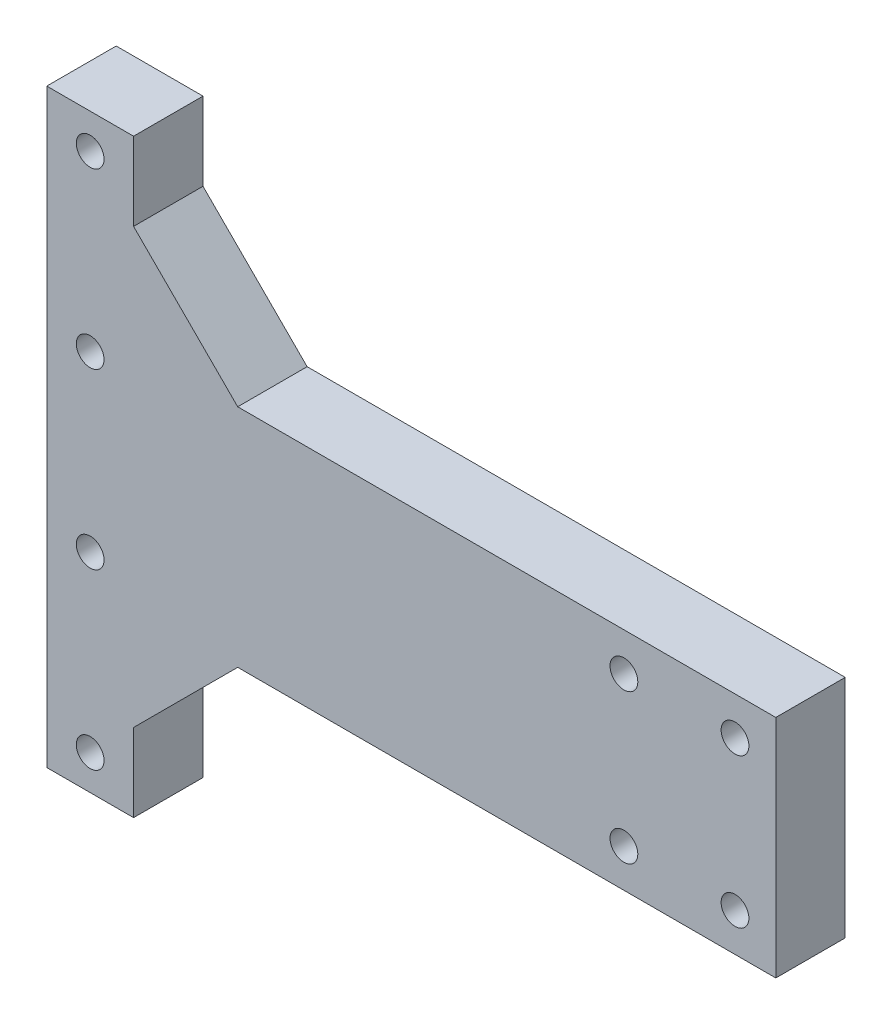
ISO-10303-21;
HEADER;
FILE_DESCRIPTION(('STEP AP214'),'2;1');
FILE_NAME('part.step','',(''),(''),'','','');
FILE_SCHEMA(('AUTOMOTIVE_DESIGN { 1 0 10303 214 1 1 1 1 }'));
ENDSEC;
DATA;
#1=APPLICATION_CONTEXT('core data for automotive mechanical design processes');
#2=APPLICATION_PROTOCOL_DEFINITION('international standard','automotive_design',2000,#1);
#3=PRODUCT_CONTEXT('',#1,'mechanical');
#4=PRODUCT('Part','Part','',(#3));
#5=PRODUCT_RELATED_PRODUCT_CATEGORY('part','',(#4));
#6=PRODUCT_DEFINITION_FORMATION('','',#4);
#7=PRODUCT_DEFINITION_CONTEXT('part definition',#1,'design');
#8=PRODUCT_DEFINITION('design','',#6,#7);
#9=PRODUCT_DEFINITION_SHAPE('','',#8);
#10=(LENGTH_UNIT() NAMED_UNIT(*) SI_UNIT(.MILLI.,.METRE.));
#11=(NAMED_UNIT(*) PLANE_ANGLE_UNIT() SI_UNIT($,.RADIAN.));
#12=(NAMED_UNIT(*) SI_UNIT($,.STERADIAN.) SOLID_ANGLE_UNIT());
#13=UNCERTAINTY_MEASURE_WITH_UNIT(LENGTH_MEASURE(1.E-05),#10,'distance_accuracy_value','');
#14=(GEOMETRIC_REPRESENTATION_CONTEXT(3) GLOBAL_UNCERTAINTY_ASSIGNED_CONTEXT((#13)) GLOBAL_UNIT_ASSIGNED_CONTEXT((#10,
#11,#12)) REPRESENTATION_CONTEXT('',''));
#15=CARTESIAN_POINT('',(0.,0.,0.));
#16=DIRECTION('',(0.,0.,1.));
#17=DIRECTION('',(1.,0.,0.));
#18=AXIS2_PLACEMENT_3D('',#15,#16,#17);
#19=CARTESIAN_POINT('',(0.,0.,40.));
#20=DIRECTION('',(0.,1.,0.));
#21=DIRECTION('',(0.,0.,1.));
#22=AXIS2_PLACEMENT_3D('',#19,#20,#21);
#23=PLANE('',#22);
#24=DIRECTION('',(1.,0.,0.));
#25=VECTOR('',#24,1.);
#26=CARTESIAN_POINT('',(0.,0.,0.));
#27=LINE('',#26,#25);
#28=CARTESIAN_POINT('',(0.,0.,0.));
#29=VERTEX_POINT('',#28);
#30=CARTESIAN_POINT('',(50.,0.,0.));
#31=VERTEX_POINT('',#30);
#32=EDGE_CURVE('E154',#29,#31,#27,.T.);
#33=ORIENTED_EDGE('',*,*,#32,.T.);
#34=DIRECTION('',(0.,0.,-1.));
#35=VECTOR('',#34,1.);
#36=CARTESIAN_POINT('',(50.,0.,40.));
#37=LINE('',#36,#35);
#38=CARTESIAN_POINT('',(50.,0.,40.));
#39=VERTEX_POINT('',#38);
#40=EDGE_CURVE('E11',#39,#31,#37,.T.);
#41=ORIENTED_EDGE('',*,*,#40,.F.);
#42=DIRECTION('',(1.,0.,0.));
#43=VECTOR('',#42,1.);
#44=CARTESIAN_POINT('',(0.,0.,40.));
#45=LINE('',#44,#43);
#46=CARTESIAN_POINT('',(0.,0.,40.));
#47=VERTEX_POINT('',#46);
#48=EDGE_CURVE('E183',#47,#39,#45,.T.);
#49=ORIENTED_EDGE('',*,*,#48,.F.);
#50=DIRECTION('',(0.,0.,-1.));
#51=VECTOR('',#50,1.);
#52=CARTESIAN_POINT('',(0.,0.,40.));
#53=LINE('',#52,#51);
#54=EDGE_CURVE('E150',#47,#29,#53,.T.);
#55=ORIENTED_EDGE('',*,*,#54,.T.);
#56=EDGE_LOOP('',(#33,#41,#49,#55));
#57=FACE_BOUND('',#56,.T.);
#58=ADVANCED_FACE('F39',(#57),#23,.F.);
#59=CARTESIAN_POINT('',(50.,0.,40.));
#60=DIRECTION('',(-1.,0.,0.));
#61=DIRECTION('',(0.,0.,1.));
#62=AXIS2_PLACEMENT_3D('',#59,#60,#61);
#63=PLANE('',#62);
#64=DIRECTION('',(0.,1.,0.));
#65=VECTOR('',#64,1.);
#66=CARTESIAN_POINT('',(50.,0.,0.));
#67=LINE('',#66,#65);
#68=CARTESIAN_POINT('',(50.,45.,0.));
#69=VERTEX_POINT('',#68);
#70=EDGE_CURVE('E158',#31,#69,#67,.T.);
#71=ORIENTED_EDGE('',*,*,#70,.T.);
#72=DIRECTION('',(0.,0.,-1.));
#73=VECTOR('',#72,1.);
#74=CARTESIAN_POINT('',(50.,45.,40.));
#75=LINE('',#74,#73);
#76=CARTESIAN_POINT('',(50.,45.,40.));
#77=VERTEX_POINT('',#76);
#78=EDGE_CURVE('E49',#77,#69,#75,.T.);
#79=ORIENTED_EDGE('',*,*,#78,.F.);
#80=DIRECTION('',(0.,1.,0.));
#81=VECTOR('',#80,1.);
#82=CARTESIAN_POINT('',(50.,0.,40.));
#83=LINE('',#82,#81);
#84=EDGE_CURVE('E107',#39,#77,#83,.T.);
#85=ORIENTED_EDGE('',*,*,#84,.F.);
#86=ORIENTED_EDGE('',*,*,#40,.T.);
#87=EDGE_LOOP('',(#71,#79,#85,#86));
#88=FACE_BOUND('',#87,.T.);
#89=ADVANCED_FACE('F325',(#88),#63,.F.);
#90=CARTESIAN_POINT('',(50.,45.,40.));
#91=DIRECTION('',(-0.707106781186546,0.707106781186549,0.));
#92=DIRECTION('',(-0.707106781186549,-0.707106781186546,0.));
#93=AXIS2_PLACEMENT_3D('',#90,#91,#92);
#94=PLANE('',#93);
#95=DIRECTION('',(0.707106781186549,0.707106781186546,0.));
#96=VECTOR('',#95,1.);
#97=CARTESIAN_POINT('',(50.,45.,0.));
#98=LINE('',#97,#96);
#99=CARTESIAN_POINT('',(110.,105.,0.));
#100=VERTEX_POINT('',#99);
#101=EDGE_CURVE('E162',#69,#100,#98,.T.);
#102=ORIENTED_EDGE('',*,*,#101,.T.);
#103=DIRECTION('',(0.,0.,-1.));
#104=VECTOR('',#103,1.);
#105=CARTESIAN_POINT('',(110.,105.,40.));
#106=LINE('',#105,#104);
#107=CARTESIAN_POINT('',(110.,105.,40.));
#108=VERTEX_POINT('',#107);
#109=EDGE_CURVE('E202',#108,#100,#106,.T.);
#110=ORIENTED_EDGE('',*,*,#109,.F.);
#111=DIRECTION('',(0.707106781186549,0.707106781186546,0.));
#112=VECTOR('',#111,1.);
#113=CARTESIAN_POINT('',(50.,45.,40.));
#114=LINE('',#113,#112);
#115=EDGE_CURVE('E273',#77,#108,#114,.T.);
#116=ORIENTED_EDGE('',*,*,#115,.F.);
#117=ORIENTED_EDGE('',*,*,#78,.T.);
#118=EDGE_LOOP('',(#102,#110,#116,#117));
#119=FACE_BOUND('',#118,.T.);
#120=ADVANCED_FACE('F329',(#119),#94,.F.);
#121=CARTESIAN_POINT('',(110.,105.,40.));
#122=DIRECTION('',(0.,1.,0.));
#123=DIRECTION('',(0.,0.,1.));
#124=AXIS2_PLACEMENT_3D('',#121,#122,#123);
#125=PLANE('',#124);
#126=DIRECTION('',(1.,0.,0.));
#127=VECTOR('',#126,1.);
#128=CARTESIAN_POINT('',(110.,105.,0.));
#129=LINE('',#128,#127);
#130=CARTESIAN_POINT('',(420.,105.,0.));
#131=VERTEX_POINT('',#130);
#132=EDGE_CURVE('E165',#100,#131,#129,.T.);
#133=ORIENTED_EDGE('',*,*,#132,.T.);
#134=DIRECTION('',(0.,0.,-1.));
#135=VECTOR('',#134,1.);
#136=CARTESIAN_POINT('',(420.,105.,40.));
#137=LINE('',#136,#135);
#138=CARTESIAN_POINT('',(420.,105.,40.));
#139=VERTEX_POINT('',#138);
#140=EDGE_CURVE('E198',#139,#131,#137,.T.);
#141=ORIENTED_EDGE('',*,*,#140,.F.);
#142=DIRECTION('',(1.,0.,0.));
#143=VECTOR('',#142,1.);
#144=CARTESIAN_POINT('',(110.,105.,40.));
#145=LINE('',#144,#143);
#146=EDGE_CURVE('E276',#108,#139,#145,.T.);
#147=ORIENTED_EDGE('',*,*,#146,.F.);
#148=ORIENTED_EDGE('',*,*,#109,.T.);
#149=EDGE_LOOP('',(#133,#141,#147,#148));
#150=FACE_BOUND('',#149,.T.);
#151=ADVANCED_FACE('F333',(#150),#125,.F.);
#152=CARTESIAN_POINT('',(420.,235.,40.));
#153=DIRECTION('',(-1.,0.,0.));
#154=DIRECTION('',(0.,0.,1.));
#155=AXIS2_PLACEMENT_3D('',#152,#153,#154);
#156=PLANE('',#155);
#157=DIRECTION('',(0.,1.,0.));
#158=VECTOR('',#157,1.);
#159=CARTESIAN_POINT('',(420.,235.,0.));
#160=LINE('',#159,#158);
#161=CARTESIAN_POINT('',(420.,235.,0.));
#162=VERTEX_POINT('',#161);
#163=EDGE_CURVE('E168',#131,#162,#160,.T.);
#164=ORIENTED_EDGE('',*,*,#163,.T.);
#165=DIRECTION('',(0.,0.,-1.));
#166=VECTOR('',#165,1.);
#167=CARTESIAN_POINT('',(420.,235.,40.));
#168=LINE('',#167,#166);
#169=CARTESIAN_POINT('',(420.,235.,40.));
#170=VERTEX_POINT('',#169);
#171=EDGE_CURVE('E194',#170,#162,#168,.T.);
#172=ORIENTED_EDGE('',*,*,#171,.F.);
#173=DIRECTION('',(0.,1.,0.));
#174=VECTOR('',#173,1.);
#175=CARTESIAN_POINT('',(420.,235.,40.));
#176=LINE('',#175,#174);
#177=EDGE_CURVE('E279',#139,#170,#176,.T.);
#178=ORIENTED_EDGE('',*,*,#177,.F.);
#179=ORIENTED_EDGE('',*,*,#140,.T.);
#180=EDGE_LOOP('',(#164,#172,#178,#179));
#181=FACE_BOUND('',#180,.T.);
#182=ADVANCED_FACE('F339',(#181),#156,.F.);
#183=CARTESIAN_POINT('',(110.,235.,40.));
#184=DIRECTION('',(0.,-1.,0.));
#185=DIRECTION('',(0.,0.,-1.));
#186=AXIS2_PLACEMENT_3D('',#183,#184,#185);
#187=PLANE('',#186);
#188=DIRECTION('',(-1.,0.,0.));
#189=VECTOR('',#188,1.);
#190=CARTESIAN_POINT('',(110.,235.,0.));
#191=LINE('',#190,#189);
#192=CARTESIAN_POINT('',(110.,235.,0.));
#193=VERTEX_POINT('',#192);
#194=EDGE_CURVE('E171',#162,#193,#191,.T.);
#195=ORIENTED_EDGE('',*,*,#194,.T.);
#196=DIRECTION('',(0.,0.,-1.));
#197=VECTOR('',#196,1.);
#198=CARTESIAN_POINT('',(110.,235.,40.));
#199=LINE('',#198,#197);
#200=CARTESIAN_POINT('',(110.,235.,40.));
#201=VERTEX_POINT('',#200);
#202=EDGE_CURVE('E190',#201,#193,#199,.T.);
#203=ORIENTED_EDGE('',*,*,#202,.F.);
#204=DIRECTION('',(-1.,0.,0.));
#205=VECTOR('',#204,1.);
#206=CARTESIAN_POINT('',(110.,235.,40.));
#207=LINE('',#206,#205);
#208=EDGE_CURVE('E282',#170,#201,#207,.T.);
#209=ORIENTED_EDGE('',*,*,#208,.F.);
#210=ORIENTED_EDGE('',*,*,#171,.T.);
#211=EDGE_LOOP('',(#195,#203,#209,#210));
#212=FACE_BOUND('',#211,.T.);
#213=ADVANCED_FACE('F343',(#212),#187,.F.);
#214=CARTESIAN_POINT('',(49.9999999999999,295.,40.));
#215=DIRECTION('',(-0.707106781186548,-0.707106781186547,0.));
#216=DIRECTION('',(0.707106781186547,-0.707106781186548,0.));
#217=AXIS2_PLACEMENT_3D('',#214,#215,#216);
#218=PLANE('',#217);
#219=DIRECTION('',(-0.707106781186547,0.707106781186548,0.));
#220=VECTOR('',#219,1.);
#221=CARTESIAN_POINT('',(49.9999999999999,295.,0.));
#222=LINE('',#221,#220);
#223=CARTESIAN_POINT('',(49.9999999999999,295.,0.));
#224=VERTEX_POINT('',#223);
#225=EDGE_CURVE('E174',#193,#224,#222,.T.);
#226=ORIENTED_EDGE('',*,*,#225,.T.);
#227=DIRECTION('',(0.,0.,-1.));
#228=VECTOR('',#227,1.);
#229=CARTESIAN_POINT('',(49.9999999999999,295.,40.));
#230=LINE('',#229,#228);
#231=CARTESIAN_POINT('',(49.9999999999999,295.,40.));
#232=VERTEX_POINT('',#231);
#233=EDGE_CURVE('E143',#232,#224,#230,.T.);
#234=ORIENTED_EDGE('',*,*,#233,.F.);
#235=DIRECTION('',(-0.707106781186547,0.707106781186548,0.));
#236=VECTOR('',#235,1.);
#237=CARTESIAN_POINT('',(49.9999999999999,295.,40.));
#238=LINE('',#237,#236);
#239=EDGE_CURVE('E132',#201,#232,#238,.T.);
#240=ORIENTED_EDGE('',*,*,#239,.F.);
#241=ORIENTED_EDGE('',*,*,#202,.T.);
#242=EDGE_LOOP('',(#226,#234,#240,#241));
#243=FACE_BOUND('',#242,.T.);
#244=ADVANCED_FACE('F347',(#243),#218,.F.);
#245=CARTESIAN_POINT('',(49.9999999999999,340.,40.));
#246=DIRECTION('',(-1.,0.,0.));
#247=DIRECTION('',(0.,-1.,0.));
#248=AXIS2_PLACEMENT_3D('',#245,#246,#247);
#249=PLANE('',#248);
#250=DIRECTION('',(0.,1.,0.));
#251=VECTOR('',#250,1.);
#252=CARTESIAN_POINT('',(49.9999999999999,340.,0.));
#253=LINE('',#252,#251);
#254=CARTESIAN_POINT('',(49.9999999999999,340.,0.));
#255=VERTEX_POINT('',#254);
#256=EDGE_CURVE('E141',#224,#255,#253,.T.);
#257=ORIENTED_EDGE('',*,*,#256,.T.);
#258=DIRECTION('',(0.,0.,-1.));
#259=VECTOR('',#258,1.);
#260=CARTESIAN_POINT('',(49.9999999999999,340.,40.));
#261=LINE('',#260,#259);
#262=CARTESIAN_POINT('',(49.9999999999999,340.,40.));
#263=VERTEX_POINT('',#262);
#264=EDGE_CURVE('E138',#263,#255,#261,.T.);
#265=ORIENTED_EDGE('',*,*,#264,.F.);
#266=DIRECTION('',(0.,1.,0.));
#267=VECTOR('',#266,1.);
#268=CARTESIAN_POINT('',(49.9999999999999,340.,40.));
#269=LINE('',#268,#267);
#270=EDGE_CURVE('E126',#232,#263,#269,.T.);
#271=ORIENTED_EDGE('',*,*,#270,.F.);
#272=ORIENTED_EDGE('',*,*,#233,.T.);
#273=EDGE_LOOP('',(#257,#265,#271,#272));
#274=FACE_BOUND('',#273,.T.);
#275=ADVANCED_FACE('F139',(#274),#249,.F.);
#276=CARTESIAN_POINT('',(0.,340.,40.));
#277=DIRECTION('',(0.,-1.,0.));
#278=DIRECTION('',(1.,0.,0.));
#279=AXIS2_PLACEMENT_3D('',#276,#277,#278);
#280=PLANE('',#279);
#281=DIRECTION('',(-1.,0.,0.));
#282=VECTOR('',#281,1.);
#283=CARTESIAN_POINT('',(0.,340.,0.));
#284=LINE('',#283,#282);
#285=CARTESIAN_POINT('',(0.,340.,0.));
#286=VERTEX_POINT('',#285);
#287=EDGE_CURVE('E93',#255,#286,#284,.T.);
#288=ORIENTED_EDGE('',*,*,#287,.T.);
#289=DIRECTION('',(0.,0.,-1.));
#290=VECTOR('',#289,1.);
#291=CARTESIAN_POINT('',(0.,340.,40.));
#292=LINE('',#291,#290);
#293=CARTESIAN_POINT('',(0.,340.,40.));
#294=VERTEX_POINT('',#293);
#295=EDGE_CURVE('E144',#294,#286,#292,.T.);
#296=ORIENTED_EDGE('',*,*,#295,.F.);
#297=DIRECTION('',(-1.,0.,0.));
#298=VECTOR('',#297,1.);
#299=CARTESIAN_POINT('',(0.,340.,40.));
#300=LINE('',#299,#298);
#301=EDGE_CURVE('E130',#263,#294,#300,.T.);
#302=ORIENTED_EDGE('',*,*,#301,.F.);
#303=ORIENTED_EDGE('',*,*,#264,.T.);
#304=EDGE_LOOP('',(#288,#296,#302,#303));
#305=FACE_BOUND('',#304,.T.);
#306=ADVANCED_FACE('F146',(#305),#280,.F.);
#307=CARTESIAN_POINT('',(0.,0.,40.));
#308=DIRECTION('',(1.,0.,0.));
#309=DIRECTION('',(0.,0.,-1.));
#310=AXIS2_PLACEMENT_3D('',#307,#308,#309);
#311=PLANE('',#310);
#312=DIRECTION('',(0.,-1.,0.));
#313=VECTOR('',#312,1.);
#314=CARTESIAN_POINT('',(0.,0.,0.));
#315=LINE('',#314,#313);
#316=EDGE_CURVE('E99',#286,#29,#315,.T.);
#317=ORIENTED_EDGE('',*,*,#316,.T.);
#318=ORIENTED_EDGE('',*,*,#54,.F.);
#319=DIRECTION('',(0.,-1.,0.));
#320=VECTOR('',#319,1.);
#321=CARTESIAN_POINT('',(0.,0.,40.));
#322=LINE('',#321,#320);
#323=EDGE_CURVE('E58',#294,#47,#322,.T.);
#324=ORIENTED_EDGE('',*,*,#323,.F.);
#325=ORIENTED_EDGE('',*,*,#295,.T.);
#326=EDGE_LOOP('',(#317,#318,#324,#325));
#327=FACE_BOUND('',#326,.T.);
#328=ADVANCED_FACE('F314',(#327),#311,.F.);
#329=CARTESIAN_POINT('',(0.,0.,40.));
#330=DIRECTION('',(0.,0.,1.));
#331=DIRECTION('',(1.,0.,0.));
#332=AXIS2_PLACEMENT_3D('',#329,#330,#331);
#333=PLANE('',#332);
#334=CARTESIAN_POINT('',(396.5,127.,40.));
#335=DIRECTION('',(0.,0.,1.));
#336=DIRECTION('',(1.,0.,0.));
#337=AXIS2_PLACEMENT_3D('',#334,#335,#336);
#338=CIRCLE('',#337,7.99999999999999);
#339=CARTESIAN_POINT('',(404.5,127.,40.));
#340=VERTEX_POINT('',#339);
#341=EDGE_CURVE('E214',#340,#340,#338,.F.);
#342=ORIENTED_EDGE('',*,*,#341,.T.);
#343=EDGE_LOOP('',(#342));
#344=FACE_BOUND('',#343,.T.);
#345=CARTESIAN_POINT('',(332.5,127.,40.));
#346=DIRECTION('',(0.,0.,1.));
#347=DIRECTION('',(1.,0.,0.));
#348=AXIS2_PLACEMENT_3D('',#345,#346,#347);
#349=CIRCLE('',#348,7.99999999999999);
#350=CARTESIAN_POINT('',(340.5,127.,40.));
#351=VERTEX_POINT('',#350);
#352=EDGE_CURVE('E241',#351,#351,#349,.F.);
#353=ORIENTED_EDGE('',*,*,#352,.T.);
#354=EDGE_LOOP('',(#353));
#355=FACE_BOUND('',#354,.T.);
#356=CARTESIAN_POINT('',(332.5,213.,40.));
#357=DIRECTION('',(0.,0.,1.));
#358=DIRECTION('',(1.,0.,0.));
#359=AXIS2_PLACEMENT_3D('',#356,#357,#358);
#360=CIRCLE('',#359,7.99999999999999);
#361=CARTESIAN_POINT('',(340.5,213.,40.));
#362=VERTEX_POINT('',#361);
#363=EDGE_CURVE('E237',#362,#362,#360,.F.);
#364=ORIENTED_EDGE('',*,*,#363,.T.);
#365=EDGE_LOOP('',(#364));
#366=FACE_BOUND('',#365,.T.);
#367=CARTESIAN_POINT('',(396.5,213.,40.));
#368=DIRECTION('',(0.,0.,1.));
#369=DIRECTION('',(1.,0.,0.));
#370=AXIS2_PLACEMENT_3D('',#367,#368,#369);
#371=CIRCLE('',#370,7.99999999999999);
#372=CARTESIAN_POINT('',(404.5,213.,40.));
#373=VERTEX_POINT('',#372);
#374=EDGE_CURVE('E233',#373,#373,#371,.F.);
#375=ORIENTED_EDGE('',*,*,#374,.T.);
#376=EDGE_LOOP('',(#375));
#377=FACE_BOUND('',#376,.T.);
#378=CARTESIAN_POINT('',(25.,20.,40.));
#379=DIRECTION('',(0.,0.,1.));
#380=DIRECTION('',(1.,0.,0.));
#381=AXIS2_PLACEMENT_3D('',#378,#379,#380);
#382=CIRCLE('',#381,8.);
#383=CARTESIAN_POINT('',(33.,20.,40.));
#384=VERTEX_POINT('',#383);
#385=EDGE_CURVE('E159',#384,#384,#382,.F.);
#386=ORIENTED_EDGE('',*,*,#385,.T.);
#387=EDGE_LOOP('',(#386));
#388=FACE_BOUND('',#387,.T.);
#389=CARTESIAN_POINT('',(25.,120.,40.));
#390=DIRECTION('',(0.,0.,1.));
#391=DIRECTION('',(1.,0.,0.));
#392=AXIS2_PLACEMENT_3D('',#389,#390,#391);
#393=CIRCLE('',#392,8.);
#394=CARTESIAN_POINT('',(33.,120.,40.));
#395=VERTEX_POINT('',#394);
#396=EDGE_CURVE('E224',#395,#395,#393,.F.);
#397=ORIENTED_EDGE('',*,*,#396,.T.);
#398=EDGE_LOOP('',(#397));
#399=FACE_BOUND('',#398,.T.);
#400=CARTESIAN_POINT('',(25.,320.,40.));
#401=DIRECTION('',(0.,0.,1.));
#402=DIRECTION('',(1.,0.,0.));
#403=AXIS2_PLACEMENT_3D('',#400,#401,#402);
#404=CIRCLE('',#403,8.);
#405=CARTESIAN_POINT('',(33.,320.,40.));
#406=VERTEX_POINT('',#405);
#407=EDGE_CURVE('E219',#406,#406,#404,.F.);
#408=ORIENTED_EDGE('',*,*,#407,.T.);
#409=EDGE_LOOP('',(#408));
#410=FACE_BOUND('',#409,.T.);
#411=CARTESIAN_POINT('',(25.,220.,40.));
#412=DIRECTION('',(0.,0.,1.));
#413=DIRECTION('',(1.,0.,0.));
#414=AXIS2_PLACEMENT_3D('',#411,#412,#413);
#415=CIRCLE('',#414,8.);
#416=CARTESIAN_POINT('',(33.,220.,40.));
#417=VERTEX_POINT('',#416);
#418=EDGE_CURVE('E213',#417,#417,#415,.F.);
#419=ORIENTED_EDGE('',*,*,#418,.T.);
#420=EDGE_LOOP('',(#419));
#421=FACE_BOUND('',#420,.T.);
#422=ORIENTED_EDGE('',*,*,#48,.T.);
#423=ORIENTED_EDGE('',*,*,#84,.T.);
#424=ORIENTED_EDGE('',*,*,#115,.T.);
#425=ORIENTED_EDGE('',*,*,#146,.T.);
#426=ORIENTED_EDGE('',*,*,#177,.T.);
#427=ORIENTED_EDGE('',*,*,#208,.T.);
#428=ORIENTED_EDGE('',*,*,#239,.T.);
#429=ORIENTED_EDGE('',*,*,#270,.T.);
#430=ORIENTED_EDGE('',*,*,#301,.T.);
#431=ORIENTED_EDGE('',*,*,#323,.T.);
#432=EDGE_LOOP('',(#422,#423,#424,#425,#426,#427,#428,#429,#430,#431));
#433=FACE_BOUND('',#432,.T.);
#434=ADVANCED_FACE('F128',(#344,#355,#366,#377,#388,#399,#410,#421,#433),#333,.T.);
#435=CARTESIAN_POINT('',(0.,0.,0.));
#436=DIRECTION('',(0.,0.,1.));
#437=DIRECTION('',(1.,0.,0.));
#438=AXIS2_PLACEMENT_3D('',#435,#436,#437);
#439=PLANE('',#438);
#440=CARTESIAN_POINT('',(396.5,127.,0.));
#441=DIRECTION('',(0.,0.,1.));
#442=DIRECTION('',(1.,0.,0.));
#443=AXIS2_PLACEMENT_3D('',#440,#441,#442);
#444=CIRCLE('',#443,7.99999999999999);
#445=CARTESIAN_POINT('',(404.5,127.,0.));
#446=VERTEX_POINT('',#445);
#447=EDGE_CURVE('E42',#446,#446,#444,.F.);
#448=ORIENTED_EDGE('',*,*,#447,.F.);
#449=EDGE_LOOP('',(#448));
#450=FACE_BOUND('',#449,.T.);
#451=CARTESIAN_POINT('',(332.5,127.,0.));
#452=DIRECTION('',(0.,0.,1.));
#453=DIRECTION('',(1.,0.,0.));
#454=AXIS2_PLACEMENT_3D('',#451,#452,#453);
#455=CIRCLE('',#454,7.99999999999999);
#456=CARTESIAN_POINT('',(340.5,127.,0.));
#457=VERTEX_POINT('',#456);
#458=EDGE_CURVE('E238',#457,#457,#455,.F.);
#459=ORIENTED_EDGE('',*,*,#458,.F.);
#460=EDGE_LOOP('',(#459));
#461=FACE_BOUND('',#460,.T.);
#462=CARTESIAN_POINT('',(332.5,213.,0.));
#463=DIRECTION('',(0.,0.,1.));
#464=DIRECTION('',(1.,0.,0.));
#465=AXIS2_PLACEMENT_3D('',#462,#463,#464);
#466=CIRCLE('',#465,7.99999999999999);
#467=CARTESIAN_POINT('',(340.5,213.,0.));
#468=VERTEX_POINT('',#467);
#469=EDGE_CURVE('E234',#468,#468,#466,.F.);
#470=ORIENTED_EDGE('',*,*,#469,.F.);
#471=EDGE_LOOP('',(#470));
#472=FACE_BOUND('',#471,.T.);
#473=CARTESIAN_POINT('',(396.5,213.,0.));
#474=DIRECTION('',(0.,0.,1.));
#475=DIRECTION('',(1.,0.,0.));
#476=AXIS2_PLACEMENT_3D('',#473,#474,#475);
#477=CIRCLE('',#476,7.99999999999999);
#478=CARTESIAN_POINT('',(404.5,213.,0.));
#479=VERTEX_POINT('',#478);
#480=EDGE_CURVE('E229',#479,#479,#477,.F.);
#481=ORIENTED_EDGE('',*,*,#480,.F.);
#482=EDGE_LOOP('',(#481));
#483=FACE_BOUND('',#482,.T.);
#484=CARTESIAN_POINT('',(25.,20.,0.));
#485=DIRECTION('',(0.,0.,1.));
#486=DIRECTION('',(1.,0.,0.));
#487=AXIS2_PLACEMENT_3D('',#484,#485,#486);
#488=CIRCLE('',#487,8.);
#489=CARTESIAN_POINT('',(33.,20.,0.));
#490=VERTEX_POINT('',#489);
#491=EDGE_CURVE('E225',#490,#490,#488,.F.);
#492=ORIENTED_EDGE('',*,*,#491,.F.);
#493=EDGE_LOOP('',(#492));
#494=FACE_BOUND('',#493,.T.);
#495=CARTESIAN_POINT('',(25.,120.,0.));
#496=DIRECTION('',(0.,0.,1.));
#497=DIRECTION('',(1.,0.,0.));
#498=AXIS2_PLACEMENT_3D('',#495,#496,#497);
#499=CIRCLE('',#498,8.);
#500=CARTESIAN_POINT('',(33.,120.,0.));
#501=VERTEX_POINT('',#500);
#502=EDGE_CURVE('E220',#501,#501,#499,.F.);
#503=ORIENTED_EDGE('',*,*,#502,.F.);
#504=EDGE_LOOP('',(#503));
#505=FACE_BOUND('',#504,.T.);
#506=CARTESIAN_POINT('',(25.,320.,0.));
#507=DIRECTION('',(0.,0.,1.));
#508=DIRECTION('',(1.,0.,0.));
#509=AXIS2_PLACEMENT_3D('',#506,#507,#508);
#510=CIRCLE('',#509,8.);
#511=CARTESIAN_POINT('',(33.,320.,0.));
#512=VERTEX_POINT('',#511);
#513=EDGE_CURVE('E215',#512,#512,#510,.F.);
#514=ORIENTED_EDGE('',*,*,#513,.F.);
#515=EDGE_LOOP('',(#514));
#516=FACE_BOUND('',#515,.T.);
#517=CARTESIAN_POINT('',(25.,220.,0.));
#518=DIRECTION('',(0.,0.,1.));
#519=DIRECTION('',(1.,0.,0.));
#520=AXIS2_PLACEMENT_3D('',#517,#518,#519);
#521=CIRCLE('',#520,8.);
#522=CARTESIAN_POINT('',(33.,220.,0.));
#523=VERTEX_POINT('',#522);
#524=EDGE_CURVE('E209',#523,#523,#521,.F.);
#525=ORIENTED_EDGE('',*,*,#524,.F.);
#526=EDGE_LOOP('',(#525));
#527=FACE_BOUND('',#526,.T.);
#528=ORIENTED_EDGE('',*,*,#32,.F.);
#529=ORIENTED_EDGE('',*,*,#316,.F.);
#530=ORIENTED_EDGE('',*,*,#287,.F.);
#531=ORIENTED_EDGE('',*,*,#256,.F.);
#532=ORIENTED_EDGE('',*,*,#225,.F.);
#533=ORIENTED_EDGE('',*,*,#194,.F.);
#534=ORIENTED_EDGE('',*,*,#163,.F.);
#535=ORIENTED_EDGE('',*,*,#132,.F.);
#536=ORIENTED_EDGE('',*,*,#101,.F.);
#537=ORIENTED_EDGE('',*,*,#70,.F.);
#538=EDGE_LOOP('',(#528,#529,#530,#531,#532,#533,#534,#535,#536,#537));
#539=FACE_BOUND('',#538,.T.);
#540=ADVANCED_FACE('F291',(#450,#461,#472,#483,#494,#505,#516,#527,#539),#439,.F.);
#541=CARTESIAN_POINT('',(25.,220.,273.));
#542=DIRECTION('',(0.,0.,-1.));
#543=DIRECTION('',(-1.,0.,0.));
#544=AXIS2_PLACEMENT_3D('',#541,#542,#543);
#545=CYLINDRICAL_SURFACE('',#544,8.);
#546=ORIENTED_EDGE('',*,*,#418,.F.);
#547=EDGE_LOOP('',(#546));
#548=FACE_BOUND('',#547,.T.);
#549=ORIENTED_EDGE('',*,*,#524,.T.);
#550=EDGE_LOOP('',(#549));
#551=FACE_BOUND('',#550,.T.);
#552=ADVANCED_FACE('F294',(#548,#551),#545,.F.);
#553=CARTESIAN_POINT('',(25.,320.,273.));
#554=DIRECTION('',(0.,0.,-1.));
#555=DIRECTION('',(-1.,0.,0.));
#556=AXIS2_PLACEMENT_3D('',#553,#554,#555);
#557=CYLINDRICAL_SURFACE('',#556,8.);
#558=ORIENTED_EDGE('',*,*,#407,.F.);
#559=EDGE_LOOP('',(#558));
#560=FACE_BOUND('',#559,.T.);
#561=ORIENTED_EDGE('',*,*,#513,.T.);
#562=EDGE_LOOP('',(#561));
#563=FACE_BOUND('',#562,.T.);
#564=ADVANCED_FACE('F375',(#560,#563),#557,.F.);
#565=CARTESIAN_POINT('',(25.,120.,273.));
#566=DIRECTION('',(0.,0.,-1.));
#567=DIRECTION('',(-1.,0.,0.));
#568=AXIS2_PLACEMENT_3D('',#565,#566,#567);
#569=CYLINDRICAL_SURFACE('',#568,8.);
#570=ORIENTED_EDGE('',*,*,#396,.F.);
#571=EDGE_LOOP('',(#570));
#572=FACE_BOUND('',#571,.T.);
#573=ORIENTED_EDGE('',*,*,#502,.T.);
#574=EDGE_LOOP('',(#573));
#575=FACE_BOUND('',#574,.T.);
#576=ADVANCED_FACE('F386',(#572,#575),#569,.F.);
#577=CARTESIAN_POINT('',(25.,20.,273.));
#578=DIRECTION('',(0.,0.,-1.));
#579=DIRECTION('',(-1.,0.,0.));
#580=AXIS2_PLACEMENT_3D('',#577,#578,#579);
#581=CYLINDRICAL_SURFACE('',#580,8.);
#582=ORIENTED_EDGE('',*,*,#385,.F.);
#583=EDGE_LOOP('',(#582));
#584=FACE_BOUND('',#583,.T.);
#585=ORIENTED_EDGE('',*,*,#491,.T.);
#586=EDGE_LOOP('',(#585));
#587=FACE_BOUND('',#586,.T.);
#588=ADVANCED_FACE('F396',(#584,#587),#581,.F.);
#589=CARTESIAN_POINT('',(396.5,213.,121.));
#590=DIRECTION('',(0.,0.,-1.));
#591=DIRECTION('',(-1.,0.,0.));
#592=AXIS2_PLACEMENT_3D('',#589,#590,#591);
#593=CYLINDRICAL_SURFACE('',#592,7.99999999999999);
#594=ORIENTED_EDGE('',*,*,#374,.F.);
#595=EDGE_LOOP('',(#594));
#596=FACE_BOUND('',#595,.T.);
#597=ORIENTED_EDGE('',*,*,#480,.T.);
#598=EDGE_LOOP('',(#597));
#599=FACE_BOUND('',#598,.T.);
#600=ADVANCED_FACE('F406',(#596,#599),#593,.F.);
#601=CARTESIAN_POINT('',(332.5,213.,121.));
#602=DIRECTION('',(0.,0.,-1.));
#603=DIRECTION('',(-1.,0.,0.));
#604=AXIS2_PLACEMENT_3D('',#601,#602,#603);
#605=CYLINDRICAL_SURFACE('',#604,7.99999999999999);
#606=ORIENTED_EDGE('',*,*,#363,.F.);
#607=EDGE_LOOP('',(#606));
#608=FACE_BOUND('',#607,.T.);
#609=ORIENTED_EDGE('',*,*,#469,.T.);
#610=EDGE_LOOP('',(#609));
#611=FACE_BOUND('',#610,.T.);
#612=ADVANCED_FACE('F426',(#608,#611),#605,.F.);
#613=CARTESIAN_POINT('',(332.5,127.,121.));
#614=DIRECTION('',(0.,0.,-1.));
#615=DIRECTION('',(-1.,0.,0.));
#616=AXIS2_PLACEMENT_3D('',#613,#614,#615);
#617=CYLINDRICAL_SURFACE('',#616,7.99999999999999);
#618=ORIENTED_EDGE('',*,*,#352,.F.);
#619=EDGE_LOOP('',(#618));
#620=FACE_BOUND('',#619,.T.);
#621=ORIENTED_EDGE('',*,*,#458,.T.);
#622=EDGE_LOOP('',(#621));
#623=FACE_BOUND('',#622,.T.);
#624=ADVANCED_FACE('F436',(#620,#623),#617,.F.);
#625=CARTESIAN_POINT('',(396.5,127.,121.));
#626=DIRECTION('',(0.,0.,-1.));
#627=DIRECTION('',(-1.,0.,0.));
#628=AXIS2_PLACEMENT_3D('',#625,#626,#627);
#629=CYLINDRICAL_SURFACE('',#628,7.99999999999999);
#630=ORIENTED_EDGE('',*,*,#341,.F.);
#631=EDGE_LOOP('',(#630));
#632=FACE_BOUND('',#631,.T.);
#633=ORIENTED_EDGE('',*,*,#447,.T.);
#634=EDGE_LOOP('',(#633));
#635=FACE_BOUND('',#634,.T.);
#636=ADVANCED_FACE('F289',(#632,#635),#629,.F.);
#637=CLOSED_SHELL('',(#58,#89,#120,#151,#182,#213,#244,#275,#306,#328,#434,#540,#552,#564,#576,
#588,#600,#612,#624,#636));
#638=MANIFOLD_SOLID_BREP('B2',#637);
#639=ADVANCED_BREP_SHAPE_REPRESENTATION('',(#18,#638),#14);
#640=SHAPE_DEFINITION_REPRESENTATION(#9,#639);
ENDSEC;
END-ISO-10303-21;
